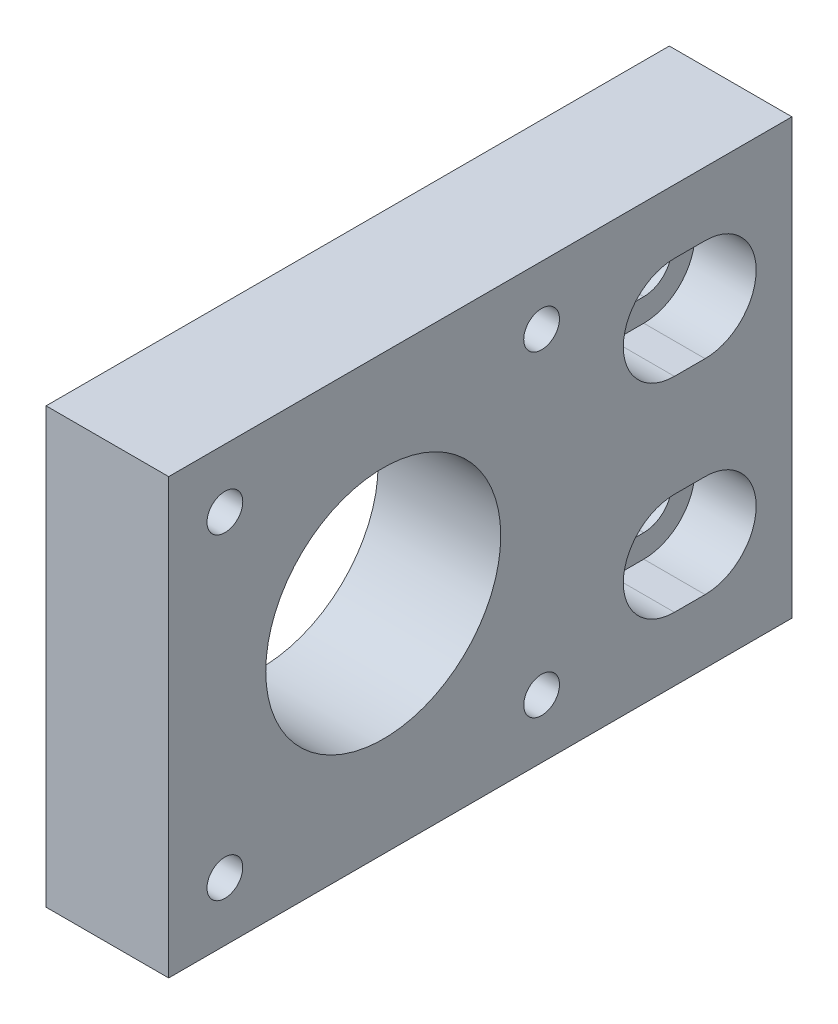
ISO-10303-21;
HEADER;
FILE_DESCRIPTION(('STEP AP214'),'2;1');
FILE_NAME('part.step','',(''),(''),'','','');
FILE_SCHEMA(('AUTOMOTIVE_DESIGN { 1 0 10303 214 1 1 1 1 }'));
ENDSEC;
DATA;
#1=APPLICATION_CONTEXT('core data for automotive mechanical design processes');
#2=APPLICATION_PROTOCOL_DEFINITION('international standard','automotive_design',2000,#1);
#3=PRODUCT_CONTEXT('',#1,'mechanical');
#4=PRODUCT('Part','Part','',(#3));
#5=PRODUCT_RELATED_PRODUCT_CATEGORY('part','',(#4));
#6=PRODUCT_DEFINITION_FORMATION('','',#4);
#7=PRODUCT_DEFINITION_CONTEXT('part definition',#1,'design');
#8=PRODUCT_DEFINITION('design','',#6,#7);
#9=PRODUCT_DEFINITION_SHAPE('','',#8);
#10=(LENGTH_UNIT() NAMED_UNIT(*) SI_UNIT(.MILLI.,.METRE.));
#11=(NAMED_UNIT(*) PLANE_ANGLE_UNIT() SI_UNIT($,.RADIAN.));
#12=(NAMED_UNIT(*) SI_UNIT($,.STERADIAN.) SOLID_ANGLE_UNIT());
#13=UNCERTAINTY_MEASURE_WITH_UNIT(LENGTH_MEASURE(1.E-05),#10,'distance_accuracy_value','');
#14=(GEOMETRIC_REPRESENTATION_CONTEXT(3) GLOBAL_UNCERTAINTY_ASSIGNED_CONTEXT((#13)) GLOBAL_UNIT_ASSIGNED_CONTEXT((#10,
#11,#12)) REPRESENTATION_CONTEXT('',''));
#15=CARTESIAN_POINT('',(0.,0.,0.));
#16=DIRECTION('',(0.,0.,1.));
#17=DIRECTION('',(1.,0.,0.));
#18=AXIS2_PLACEMENT_3D('',#15,#16,#17);
#19=CARTESIAN_POINT('',(12.,10.,-28.5));
#20=DIRECTION('',(-1.,0.,0.));
#21=DIRECTION('',(0.,0.,1.));
#22=AXIS2_PLACEMENT_3D('',#19,#20,#21);
#23=CYLINDRICAL_SURFACE('',#22,2.75);
#24=DIRECTION('',(-1.,0.,0.));
#25=VECTOR('',#24,1.);
#26=CARTESIAN_POINT('',(12.,12.75,-28.5));
#27=LINE('',#26,#25);
#28=CARTESIAN_POINT('',(6.,12.75,-28.5));
#29=VERTEX_POINT('',#28);
#30=CARTESIAN_POINT('',(0.,12.75,-28.5));
#31=VERTEX_POINT('',#30);
#32=EDGE_CURVE('E285',#29,#31,#27,.T.);
#33=ORIENTED_EDGE('',*,*,#32,.F.);
#34=CARTESIAN_POINT('',(6.,10.,-28.5));
#35=DIRECTION('',(1.,0.,0.));
#36=DIRECTION('',(0.,0.,-1.));
#37=AXIS2_PLACEMENT_3D('',#34,#35,#36);
#38=CIRCLE('',#37,2.75);
#39=CARTESIAN_POINT('',(6.,7.25,-28.5));
#40=VERTEX_POINT('',#39);
#41=EDGE_CURVE('E250',#29,#40,#38,.T.);
#42=ORIENTED_EDGE('',*,*,#41,.T.);
#43=DIRECTION('',(-1.,0.,0.));
#44=VECTOR('',#43,1.);
#45=CARTESIAN_POINT('',(12.,7.25,-28.5));
#46=LINE('',#45,#44);
#47=CARTESIAN_POINT('',(0.,7.25,-28.5));
#48=VERTEX_POINT('',#47);
#49=EDGE_CURVE('E291',#40,#48,#46,.T.);
#50=ORIENTED_EDGE('',*,*,#49,.T.);
#51=CARTESIAN_POINT('',(0.,10.,-28.5));
#52=DIRECTION('',(1.,0.,0.));
#53=DIRECTION('',(0.,0.,-1.));
#54=AXIS2_PLACEMENT_3D('',#51,#52,#53);
#55=CIRCLE('',#54,2.75);
#56=EDGE_CURVE('E273',#31,#48,#55,.T.);
#57=ORIENTED_EDGE('',*,*,#56,.F.);
#58=EDGE_LOOP('',(#33,#42,#50,#57));
#59=FACE_BOUND('',#58,.T.);
#60=ADVANCED_FACE('F33',(#59),#23,.F.);
#61=CARTESIAN_POINT('',(12.,7.25,-28.5));
#62=DIRECTION('',(0.,1.,0.));
#63=DIRECTION('',(0.,0.,1.));
#64=AXIS2_PLACEMENT_3D('',#61,#62,#63);
#65=PLANE('',#64);
#66=ORIENTED_EDGE('',*,*,#49,.F.);
#67=DIRECTION('',(0.,0.,-1.));
#68=VECTOR('',#67,1.);
#69=CARTESIAN_POINT('',(6.,7.25,-28.5));
#70=LINE('',#69,#68);
#71=CARTESIAN_POINT('',(6.,7.25,-31.5));
#72=VERTEX_POINT('',#71);
#73=EDGE_CURVE('E247',#40,#72,#70,.T.);
#74=ORIENTED_EDGE('',*,*,#73,.T.);
#75=DIRECTION('',(-1.,0.,0.));
#76=VECTOR('',#75,1.);
#77=CARTESIAN_POINT('',(12.,7.25,-31.5));
#78=LINE('',#77,#76);
#79=CARTESIAN_POINT('',(0.,7.25,-31.5));
#80=VERTEX_POINT('',#79);
#81=EDGE_CURVE('E289',#72,#80,#78,.T.);
#82=ORIENTED_EDGE('',*,*,#81,.T.);
#83=DIRECTION('',(0.,0.,-1.));
#84=VECTOR('',#83,1.);
#85=CARTESIAN_POINT('',(0.,7.25,-28.5));
#86=LINE('',#85,#84);
#87=EDGE_CURVE('E276',#48,#80,#86,.T.);
#88=ORIENTED_EDGE('',*,*,#87,.F.);
#89=EDGE_LOOP('',(#66,#74,#82,#88));
#90=FACE_BOUND('',#89,.T.);
#91=ADVANCED_FACE('F390',(#90),#65,.T.);
#92=CARTESIAN_POINT('',(12.,10.,-31.5));
#93=DIRECTION('',(-1.,0.,0.));
#94=DIRECTION('',(0.,0.,1.));
#95=AXIS2_PLACEMENT_3D('',#92,#93,#94);
#96=CYLINDRICAL_SURFACE('',#95,2.75);
#97=ORIENTED_EDGE('',*,*,#81,.F.);
#98=CARTESIAN_POINT('',(6.,10.,-31.5));
#99=DIRECTION('',(1.,0.,0.));
#100=DIRECTION('',(0.,0.,-1.));
#101=AXIS2_PLACEMENT_3D('',#98,#99,#100);
#102=CIRCLE('',#101,2.75);
#103=CARTESIAN_POINT('',(6.,12.75,-31.5));
#104=VERTEX_POINT('',#103);
#105=EDGE_CURVE('E244',#72,#104,#102,.T.);
#106=ORIENTED_EDGE('',*,*,#105,.T.);
#107=DIRECTION('',(-1.,0.,0.));
#108=VECTOR('',#107,1.);
#109=CARTESIAN_POINT('',(12.,12.75,-31.5));
#110=LINE('',#109,#108);
#111=CARTESIAN_POINT('',(0.,12.75,-31.5));
#112=VERTEX_POINT('',#111);
#113=EDGE_CURVE('E287',#104,#112,#110,.T.);
#114=ORIENTED_EDGE('',*,*,#113,.T.);
#115=CARTESIAN_POINT('',(0.,10.,-31.5));
#116=DIRECTION('',(1.,0.,0.));
#117=DIRECTION('',(0.,0.,-1.));
#118=AXIS2_PLACEMENT_3D('',#115,#116,#117);
#119=CIRCLE('',#118,2.75);
#120=EDGE_CURVE('E279',#80,#112,#119,.T.);
#121=ORIENTED_EDGE('',*,*,#120,.F.);
#122=EDGE_LOOP('',(#97,#106,#114,#121));
#123=FACE_BOUND('',#122,.T.);
#124=ADVANCED_FACE('F396',(#123),#96,.F.);
#125=CARTESIAN_POINT('',(12.,12.75,-28.5));
#126=DIRECTION('',(0.,-1.,0.));
#127=DIRECTION('',(0.,0.,-1.));
#128=AXIS2_PLACEMENT_3D('',#125,#126,#127);
#129=PLANE('',#128);
#130=ORIENTED_EDGE('',*,*,#113,.F.);
#131=DIRECTION('',(0.,0.,1.));
#132=VECTOR('',#131,1.);
#133=CARTESIAN_POINT('',(6.,12.75,-28.5));
#134=LINE('',#133,#132);
#135=EDGE_CURVE('E11',#104,#29,#134,.T.);
#136=ORIENTED_EDGE('',*,*,#135,.T.);
#137=ORIENTED_EDGE('',*,*,#32,.T.);
#138=DIRECTION('',(0.,0.,1.));
#139=VECTOR('',#138,1.);
#140=CARTESIAN_POINT('',(0.,12.75,-28.5));
#141=LINE('',#140,#139);
#142=EDGE_CURVE('E282',#112,#31,#141,.T.);
#143=ORIENTED_EDGE('',*,*,#142,.F.);
#144=EDGE_LOOP('',(#130,#136,#137,#143));
#145=FACE_BOUND('',#144,.T.);
#146=ADVANCED_FACE('F421',(#145),#129,.T.);
#147=CARTESIAN_POINT('',(12.,0.,0.));
#148=DIRECTION('',(-1.,0.,0.));
#149=DIRECTION('',(0.,0.,1.));
#150=AXIS2_PLACEMENT_3D('',#147,#148,#149);
#151=PLANE('',#150);
#152=DIRECTION('',(0.,0.,-1.));
#153=VECTOR('',#152,1.);
#154=CARTESIAN_POINT('',(12.,5.,-28.5));
#155=LINE('',#154,#153);
#156=CARTESIAN_POINT('',(12.,5.,-28.5));
#157=VERTEX_POINT('',#156);
#158=CARTESIAN_POINT('',(12.,5.,-31.5));
#159=VERTEX_POINT('',#158);
#160=EDGE_CURVE('E199',#157,#159,#155,.T.);
#161=ORIENTED_EDGE('',*,*,#160,.F.);
#162=CARTESIAN_POINT('',(12.,10.,-28.5));
#163=DIRECTION('',(1.,0.,0.));
#164=DIRECTION('',(0.,0.,-1.));
#165=AXIS2_PLACEMENT_3D('',#162,#163,#164);
#166=CIRCLE('',#165,5.);
#167=CARTESIAN_POINT('',(12.,15.,-28.5));
#168=VERTEX_POINT('',#167);
#169=EDGE_CURVE('E48',#168,#157,#166,.T.);
#170=ORIENTED_EDGE('',*,*,#169,.F.);
#171=DIRECTION('',(0.,0.,1.));
#172=VECTOR('',#171,1.);
#173=CARTESIAN_POINT('',(12.,15.,-28.5));
#174=LINE('',#173,#172);
#175=CARTESIAN_POINT('',(12.,15.,-31.5));
#176=VERTEX_POINT('',#175);
#177=EDGE_CURVE('E190',#176,#168,#174,.T.);
#178=ORIENTED_EDGE('',*,*,#177,.F.);
#179=CARTESIAN_POINT('',(12.,10.,-31.5));
#180=DIRECTION('',(1.,0.,0.));
#181=DIRECTION('',(0.,0.,-1.));
#182=AXIS2_PLACEMENT_3D('',#179,#180,#181);
#183=CIRCLE('',#182,5.);
#184=EDGE_CURVE('E193',#159,#176,#183,.T.);
#185=ORIENTED_EDGE('',*,*,#184,.F.);
#186=EDGE_LOOP('',(#161,#170,#178,#185));
#187=FACE_BOUND('',#186,.T.);
#188=DIRECTION('',(0.,0.,-1.));
#189=VECTOR('',#188,1.);
#190=CARTESIAN_POINT('',(12.,-15.,-28.5));
#191=LINE('',#190,#189);
#192=CARTESIAN_POINT('',(12.,-15.,-28.5));
#193=VERTEX_POINT('',#192);
#194=CARTESIAN_POINT('',(12.,-15.,-31.5));
#195=VERTEX_POINT('',#194);
#196=EDGE_CURVE('E225',#193,#195,#191,.T.);
#197=ORIENTED_EDGE('',*,*,#196,.F.);
#198=CARTESIAN_POINT('',(12.,-10.,-28.5));
#199=DIRECTION('',(1.,0.,0.));
#200=DIRECTION('',(0.,0.,1.));
#201=AXIS2_PLACEMENT_3D('',#198,#199,#200);
#202=CIRCLE('',#201,5.);
#203=CARTESIAN_POINT('',(12.,-5.00000000000001,-28.5));
#204=VERTEX_POINT('',#203);
#205=EDGE_CURVE('E56',#204,#193,#202,.T.);
#206=ORIENTED_EDGE('',*,*,#205,.F.);
#207=DIRECTION('',(0.,0.,1.));
#208=VECTOR('',#207,1.);
#209=CARTESIAN_POINT('',(12.,-5.00000000000001,-28.5));
#210=LINE('',#209,#208);
#211=CARTESIAN_POINT('',(12.,-5.00000000000001,-31.5));
#212=VERTEX_POINT('',#211);
#213=EDGE_CURVE('E214',#212,#204,#210,.T.);
#214=ORIENTED_EDGE('',*,*,#213,.F.);
#215=CARTESIAN_POINT('',(12.,-10.,-31.5));
#216=DIRECTION('',(1.,0.,0.));
#217=DIRECTION('',(0.,0.,1.));
#218=AXIS2_PLACEMENT_3D('',#215,#216,#217);
#219=CIRCLE('',#218,5.);
#220=EDGE_CURVE('E228',#195,#212,#219,.T.);
#221=ORIENTED_EDGE('',*,*,#220,.F.);
#222=EDGE_LOOP('',(#197,#206,#214,#221));
#223=FACE_BOUND('',#222,.T.);
#224=DIRECTION('',(0.,1.,0.));
#225=VECTOR('',#224,1.);
#226=CARTESIAN_POINT('',(12.,-21.25,-40.));
#227=LINE('',#226,#225);
#228=CARTESIAN_POINT('',(12.,-21.25,-40.));
#229=VERTEX_POINT('',#228);
#230=CARTESIAN_POINT('',(12.,21.25,-40.));
#231=VERTEX_POINT('',#230);
#232=EDGE_CURVE('E324',#229,#231,#227,.T.);
#233=ORIENTED_EDGE('',*,*,#232,.T.);
#234=DIRECTION('',(0.,0.,1.));
#235=VECTOR('',#234,1.);
#236=CARTESIAN_POINT('',(12.,21.25,21.));
#237=LINE('',#236,#235);
#238=CARTESIAN_POINT('',(12.,21.25,21.));
#239=VERTEX_POINT('',#238);
#240=EDGE_CURVE('E327',#231,#239,#237,.T.);
#241=ORIENTED_EDGE('',*,*,#240,.T.);
#242=DIRECTION('',(0.,-1.,0.));
#243=VECTOR('',#242,1.);
#244=CARTESIAN_POINT('',(12.,-21.25,21.));
#245=LINE('',#244,#243);
#246=CARTESIAN_POINT('',(12.,-21.25,21.));
#247=VERTEX_POINT('',#246);
#248=EDGE_CURVE('E330',#239,#247,#245,.T.);
#249=ORIENTED_EDGE('',*,*,#248,.T.);
#250=DIRECTION('',(0.,0.,-1.));
#251=VECTOR('',#250,1.);
#252=CARTESIAN_POINT('',(12.,-21.25,21.));
#253=LINE('',#252,#251);
#254=EDGE_CURVE('E332',#247,#229,#253,.T.);
#255=ORIENTED_EDGE('',*,*,#254,.T.);
#256=EDGE_LOOP('',(#233,#241,#249,#255));
#257=FACE_BOUND('',#256,.T.);
#258=CARTESIAN_POINT('',(12.,0.,0.));
#259=DIRECTION('',(1.,0.,0.));
#260=DIRECTION('',(0.,0.,-1.));
#261=AXIS2_PLACEMENT_3D('',#258,#259,#260);
#262=CIRCLE('',#261,11.5);
#263=CARTESIAN_POINT('',(12.,0.,-11.5));
#264=VERTEX_POINT('',#263);
#265=EDGE_CURVE('E318',#264,#264,#262,.T.);
#266=ORIENTED_EDGE('',*,*,#265,.F.);
#267=EDGE_LOOP('',(#266));
#268=FACE_BOUND('',#267,.T.);
#269=CARTESIAN_POINT('',(12.,15.5,15.5));
#270=DIRECTION('',(1.,0.,0.));
#271=DIRECTION('',(0.,0.,-1.));
#272=AXIS2_PLACEMENT_3D('',#269,#270,#271);
#273=CIRCLE('',#272,1.75);
#274=CARTESIAN_POINT('',(12.,15.5,13.75));
#275=VERTEX_POINT('',#274);
#276=EDGE_CURVE('E312',#275,#275,#273,.T.);
#277=ORIENTED_EDGE('',*,*,#276,.F.);
#278=EDGE_LOOP('',(#277));
#279=FACE_BOUND('',#278,.T.);
#280=CARTESIAN_POINT('',(12.,-15.5,-15.5));
#281=DIRECTION('',(1.,0.,0.));
#282=DIRECTION('',(0.,0.,-1.));
#283=AXIS2_PLACEMENT_3D('',#280,#281,#282);
#284=CIRCLE('',#283,1.75);
#285=CARTESIAN_POINT('',(12.,-15.5,-17.25));
#286=VERTEX_POINT('',#285);
#287=EDGE_CURVE('E306',#286,#286,#284,.T.);
#288=ORIENTED_EDGE('',*,*,#287,.F.);
#289=EDGE_LOOP('',(#288));
#290=FACE_BOUND('',#289,.T.);
#291=CARTESIAN_POINT('',(12.,15.5,-15.5));
#292=DIRECTION('',(1.,0.,0.));
#293=DIRECTION('',(0.,0.,1.));
#294=AXIS2_PLACEMENT_3D('',#291,#292,#293);
#295=CIRCLE('',#294,1.74999999999999);
#296=CARTESIAN_POINT('',(12.,15.5,-13.75));
#297=VERTEX_POINT('',#296);
#298=EDGE_CURVE('E300',#297,#297,#295,.T.);
#299=ORIENTED_EDGE('',*,*,#298,.F.);
#300=EDGE_LOOP('',(#299));
#301=FACE_BOUND('',#300,.T.);
#302=CARTESIAN_POINT('',(12.,-15.5,15.5));
#303=DIRECTION('',(1.,0.,0.));
#304=DIRECTION('',(0.,0.,1.));
#305=AXIS2_PLACEMENT_3D('',#302,#303,#304);
#306=CIRCLE('',#305,1.75);
#307=CARTESIAN_POINT('',(12.,-15.5,17.25));
#308=VERTEX_POINT('',#307);
#309=EDGE_CURVE('E294',#308,#308,#306,.T.);
#310=ORIENTED_EDGE('',*,*,#309,.F.);
#311=EDGE_LOOP('',(#310));
#312=FACE_BOUND('',#311,.T.);
#313=ADVANCED_FACE('F418',(#187,#223,#257,#268,#279,#290,#301,#312),#151,.F.);
#314=CARTESIAN_POINT('',(0.,0.,0.));
#315=DIRECTION('',(-1.,0.,0.));
#316=DIRECTION('',(0.,0.,1.));
#317=AXIS2_PLACEMENT_3D('',#314,#315,#316);
#318=PLANE('',#317);
#319=CARTESIAN_POINT('',(0.,15.5,-15.5));
#320=DIRECTION('',(1.,0.,0.));
#321=DIRECTION('',(0.,0.,1.));
#322=AXIS2_PLACEMENT_3D('',#319,#320,#321);
#323=CIRCLE('',#322,1.74999999999999);
#324=CARTESIAN_POINT('',(0.,15.5,-13.75));
#325=VERTEX_POINT('',#324);
#326=EDGE_CURVE('E297',#325,#325,#323,.T.);
#327=ORIENTED_EDGE('',*,*,#326,.T.);
#328=EDGE_LOOP('',(#327));
#329=FACE_BOUND('',#328,.T.);
#330=CARTESIAN_POINT('',(0.,15.5,15.5));
#331=DIRECTION('',(1.,0.,0.));
#332=DIRECTION('',(0.,0.,-1.));
#333=AXIS2_PLACEMENT_3D('',#330,#331,#332);
#334=CIRCLE('',#333,1.75);
#335=CARTESIAN_POINT('',(0.,15.5,13.75));
#336=VERTEX_POINT('',#335);
#337=EDGE_CURVE('E309',#336,#336,#334,.T.);
#338=ORIENTED_EDGE('',*,*,#337,.T.);
#339=EDGE_LOOP('',(#338));
#340=FACE_BOUND('',#339,.T.);
#341=DIRECTION('',(0.,1.,0.));
#342=VECTOR('',#341,1.);
#343=CARTESIAN_POINT('',(0.,-21.25,-40.));
#344=LINE('',#343,#342);
#345=CARTESIAN_POINT('',(0.,-21.25,-40.));
#346=VERTEX_POINT('',#345);
#347=CARTESIAN_POINT('',(0.,21.25,-40.));
#348=VERTEX_POINT('',#347);
#349=EDGE_CURVE('E321',#346,#348,#344,.T.);
#350=ORIENTED_EDGE('',*,*,#349,.F.);
#351=DIRECTION('',(0.,0.,-1.));
#352=VECTOR('',#351,1.);
#353=CARTESIAN_POINT('',(0.,-21.25,21.));
#354=LINE('',#353,#352);
#355=CARTESIAN_POINT('',(0.,-21.25,21.));
#356=VERTEX_POINT('',#355);
#357=EDGE_CURVE('E328',#356,#346,#354,.T.);
#358=ORIENTED_EDGE('',*,*,#357,.F.);
#359=DIRECTION('',(0.,-1.,0.));
#360=VECTOR('',#359,1.);
#361=CARTESIAN_POINT('',(0.,-21.25,21.));
#362=LINE('',#361,#360);
#363=CARTESIAN_POINT('',(0.,21.25,21.));
#364=VERTEX_POINT('',#363);
#365=EDGE_CURVE('E339',#364,#356,#362,.T.);
#366=ORIENTED_EDGE('',*,*,#365,.F.);
#367=DIRECTION('',(0.,0.,1.));
#368=VECTOR('',#367,1.);
#369=CARTESIAN_POINT('',(0.,21.25,21.));
#370=LINE('',#369,#368);
#371=EDGE_CURVE('E337',#348,#364,#370,.T.);
#372=ORIENTED_EDGE('',*,*,#371,.F.);
#373=EDGE_LOOP('',(#350,#358,#366,#372));
#374=FACE_BOUND('',#373,.T.);
#375=CARTESIAN_POINT('',(0.,0.,0.));
#376=DIRECTION('',(1.,0.,0.));
#377=DIRECTION('',(0.,0.,-1.));
#378=AXIS2_PLACEMENT_3D('',#375,#376,#377);
#379=CIRCLE('',#378,11.5);
#380=CARTESIAN_POINT('',(0.,0.,-11.5));
#381=VERTEX_POINT('',#380);
#382=EDGE_CURVE('E315',#381,#381,#379,.T.);
#383=ORIENTED_EDGE('',*,*,#382,.T.);
#384=EDGE_LOOP('',(#383));
#385=FACE_BOUND('',#384,.T.);
#386=CARTESIAN_POINT('',(0.,-15.5,-15.5));
#387=DIRECTION('',(1.,0.,0.));
#388=DIRECTION('',(0.,0.,-1.));
#389=AXIS2_PLACEMENT_3D('',#386,#387,#388);
#390=CIRCLE('',#389,1.75);
#391=CARTESIAN_POINT('',(0.,-15.5,-17.25));
#392=VERTEX_POINT('',#391);
#393=EDGE_CURVE('E303',#392,#392,#390,.T.);
#394=ORIENTED_EDGE('',*,*,#393,.T.);
#395=EDGE_LOOP('',(#394));
#396=FACE_BOUND('',#395,.T.);
#397=CARTESIAN_POINT('',(0.,-15.5,15.5));
#398=DIRECTION('',(1.,0.,0.));
#399=DIRECTION('',(0.,0.,1.));
#400=AXIS2_PLACEMENT_3D('',#397,#398,#399);
#401=CIRCLE('',#400,1.75);
#402=CARTESIAN_POINT('',(0.,-15.5,17.25));
#403=VERTEX_POINT('',#402);
#404=EDGE_CURVE('E293',#403,#403,#401,.T.);
#405=ORIENTED_EDGE('',*,*,#404,.T.);
#406=EDGE_LOOP('',(#405));
#407=FACE_BOUND('',#406,.T.);
#408=ORIENTED_EDGE('',*,*,#142,.T.);
#409=ORIENTED_EDGE('',*,*,#56,.T.);
#410=ORIENTED_EDGE('',*,*,#87,.T.);
#411=ORIENTED_EDGE('',*,*,#120,.T.);
#412=EDGE_LOOP('',(#408,#409,#410,#411));
#413=FACE_BOUND('',#412,.T.);
#414=DIRECTION('',(0.,0.,1.));
#415=VECTOR('',#414,1.);
#416=CARTESIAN_POINT('',(0.,-7.25,-28.5));
#417=LINE('',#416,#415);
#418=CARTESIAN_POINT('',(0.,-7.24999999999999,-31.5));
#419=VERTEX_POINT('',#418);
#420=CARTESIAN_POINT('',(0.,-7.25,-28.5));
#421=VERTEX_POINT('',#420);
#422=EDGE_CURVE('E262',#419,#421,#417,.T.);
#423=ORIENTED_EDGE('',*,*,#422,.T.);
#424=CARTESIAN_POINT('',(0.,-9.99999999999999,-28.5));
#425=DIRECTION('',(1.,0.,0.));
#426=DIRECTION('',(0.,0.,1.));
#427=AXIS2_PLACEMENT_3D('',#424,#425,#426);
#428=CIRCLE('',#427,2.75);
#429=CARTESIAN_POINT('',(0.,-12.75,-28.5));
#430=VERTEX_POINT('',#429);
#431=EDGE_CURVE('E253',#421,#430,#428,.T.);
#432=ORIENTED_EDGE('',*,*,#431,.T.);
#433=DIRECTION('',(0.,0.,-1.));
#434=VECTOR('',#433,1.);
#435=CARTESIAN_POINT('',(0.,-12.75,-28.5));
#436=LINE('',#435,#434);
#437=CARTESIAN_POINT('',(0.,-12.75,-31.5));
#438=VERTEX_POINT('',#437);
#439=EDGE_CURVE('E256',#430,#438,#436,.T.);
#440=ORIENTED_EDGE('',*,*,#439,.T.);
#441=CARTESIAN_POINT('',(0.,-9.99999999999999,-31.5));
#442=DIRECTION('',(1.,0.,0.));
#443=DIRECTION('',(0.,0.,1.));
#444=AXIS2_PLACEMENT_3D('',#441,#442,#443);
#445=CIRCLE('',#444,2.75);
#446=EDGE_CURVE('E259',#438,#419,#445,.T.);
#447=ORIENTED_EDGE('',*,*,#446,.T.);
#448=EDGE_LOOP('',(#423,#432,#440,#447));
#449=FACE_BOUND('',#448,.T.);
#450=ADVANCED_FACE('F370',(#329,#340,#374,#385,#396,#407,#413,#449),#318,.T.);
#451=CARTESIAN_POINT('',(12.,-21.25,-40.));
#452=DIRECTION('',(0.,0.,1.));
#453=DIRECTION('',(1.,0.,0.));
#454=AXIS2_PLACEMENT_3D('',#451,#452,#453);
#455=PLANE('',#454);
#456=ORIENTED_EDGE('',*,*,#349,.T.);
#457=DIRECTION('',(-1.,0.,0.));
#458=VECTOR('',#457,1.);
#459=CARTESIAN_POINT('',(12.,21.25,-40.));
#460=LINE('',#459,#458);
#461=EDGE_CURVE('E350',#231,#348,#460,.T.);
#462=ORIENTED_EDGE('',*,*,#461,.F.);
#463=ORIENTED_EDGE('',*,*,#232,.F.);
#464=DIRECTION('',(-1.,0.,0.));
#465=VECTOR('',#464,1.);
#466=CARTESIAN_POINT('',(12.,-21.25,-40.));
#467=LINE('',#466,#465);
#468=EDGE_CURVE('E334',#229,#346,#467,.T.);
#469=ORIENTED_EDGE('',*,*,#468,.T.);
#470=EDGE_LOOP('',(#456,#462,#463,#469));
#471=FACE_BOUND('',#470,.T.);
#472=ADVANCED_FACE('F35',(#471),#455,.F.);
#473=CARTESIAN_POINT('',(12.,21.25,21.));
#474=DIRECTION('',(0.,-1.,0.));
#475=DIRECTION('',(0.,0.,-1.));
#476=AXIS2_PLACEMENT_3D('',#473,#474,#475);
#477=PLANE('',#476);
#478=ORIENTED_EDGE('',*,*,#371,.T.);
#479=DIRECTION('',(-1.,0.,0.));
#480=VECTOR('',#479,1.);
#481=CARTESIAN_POINT('',(12.,21.25,21.));
#482=LINE('',#481,#480);
#483=EDGE_CURVE('E347',#239,#364,#482,.T.);
#484=ORIENTED_EDGE('',*,*,#483,.F.);
#485=ORIENTED_EDGE('',*,*,#240,.F.);
#486=ORIENTED_EDGE('',*,*,#461,.T.);
#487=EDGE_LOOP('',(#478,#484,#485,#486));
#488=FACE_BOUND('',#487,.T.);
#489=ADVANCED_FACE('F431',(#488),#477,.F.);
#490=CARTESIAN_POINT('',(12.,-21.25,21.));
#491=DIRECTION('',(0.,0.,-1.));
#492=DIRECTION('',(-1.,0.,0.));
#493=AXIS2_PLACEMENT_3D('',#490,#491,#492);
#494=PLANE('',#493);
#495=ORIENTED_EDGE('',*,*,#365,.T.);
#496=DIRECTION('',(-1.,0.,0.));
#497=VECTOR('',#496,1.);
#498=CARTESIAN_POINT('',(12.,-21.25,21.));
#499=LINE('',#498,#497);
#500=EDGE_CURVE('E344',#247,#356,#499,.T.);
#501=ORIENTED_EDGE('',*,*,#500,.F.);
#502=ORIENTED_EDGE('',*,*,#248,.F.);
#503=ORIENTED_EDGE('',*,*,#483,.T.);
#504=EDGE_LOOP('',(#495,#501,#502,#503));
#505=FACE_BOUND('',#504,.T.);
#506=ADVANCED_FACE('F428',(#505),#494,.F.);
#507=CARTESIAN_POINT('',(12.,-21.25,21.));
#508=DIRECTION('',(0.,1.,0.));
#509=DIRECTION('',(0.,0.,1.));
#510=AXIS2_PLACEMENT_3D('',#507,#508,#509);
#511=PLANE('',#510);
#512=ORIENTED_EDGE('',*,*,#357,.T.);
#513=ORIENTED_EDGE('',*,*,#468,.F.);
#514=ORIENTED_EDGE('',*,*,#254,.F.);
#515=ORIENTED_EDGE('',*,*,#500,.T.);
#516=EDGE_LOOP('',(#512,#513,#514,#515));
#517=FACE_BOUND('',#516,.T.);
#518=ADVANCED_FACE('F416',(#517),#511,.F.);
#519=CARTESIAN_POINT('',(12.,0.,0.));
#520=DIRECTION('',(-1.,0.,0.));
#521=DIRECTION('',(0.,0.,1.));
#522=AXIS2_PLACEMENT_3D('',#519,#520,#521);
#523=CYLINDRICAL_SURFACE('',#522,11.5);
#524=ORIENTED_EDGE('',*,*,#265,.T.);
#525=EDGE_LOOP('',(#524));
#526=FACE_BOUND('',#525,.T.);
#527=ORIENTED_EDGE('',*,*,#382,.F.);
#528=EDGE_LOOP('',(#527));
#529=FACE_BOUND('',#528,.T.);
#530=ADVANCED_FACE('F412',(#526,#529),#523,.F.);
#531=CARTESIAN_POINT('',(12.,15.5,15.5));
#532=DIRECTION('',(-1.,0.,0.));
#533=DIRECTION('',(0.,0.,1.));
#534=AXIS2_PLACEMENT_3D('',#531,#532,#533);
#535=CYLINDRICAL_SURFACE('',#534,1.75);
#536=ORIENTED_EDGE('',*,*,#276,.T.);
#537=EDGE_LOOP('',(#536));
#538=FACE_BOUND('',#537,.T.);
#539=ORIENTED_EDGE('',*,*,#337,.F.);
#540=EDGE_LOOP('',(#539));
#541=FACE_BOUND('',#540,.T.);
#542=ADVANCED_FACE('F408',(#538,#541),#535,.F.);
#543=CARTESIAN_POINT('',(12.,-15.5,-15.5));
#544=DIRECTION('',(-1.,0.,0.));
#545=DIRECTION('',(0.,0.,1.));
#546=AXIS2_PLACEMENT_3D('',#543,#544,#545);
#547=CYLINDRICAL_SURFACE('',#546,1.75);
#548=ORIENTED_EDGE('',*,*,#287,.T.);
#549=EDGE_LOOP('',(#548));
#550=FACE_BOUND('',#549,.T.);
#551=ORIENTED_EDGE('',*,*,#393,.F.);
#552=EDGE_LOOP('',(#551));
#553=FACE_BOUND('',#552,.T.);
#554=ADVANCED_FACE('F404',(#550,#553),#547,.F.);
#555=CARTESIAN_POINT('',(12.,15.5,-15.5));
#556=DIRECTION('',(-1.,0.,0.));
#557=DIRECTION('',(0.,0.,1.));
#558=AXIS2_PLACEMENT_3D('',#555,#556,#557);
#559=CYLINDRICAL_SURFACE('',#558,1.74999999999999);
#560=ORIENTED_EDGE('',*,*,#298,.T.);
#561=EDGE_LOOP('',(#560));
#562=FACE_BOUND('',#561,.T.);
#563=ORIENTED_EDGE('',*,*,#326,.F.);
#564=EDGE_LOOP('',(#563));
#565=FACE_BOUND('',#564,.T.);
#566=ADVANCED_FACE('F385',(#562,#565),#559,.F.);
#567=CARTESIAN_POINT('',(12.,-15.5,15.5));
#568=DIRECTION('',(-1.,0.,0.));
#569=DIRECTION('',(0.,0.,1.));
#570=AXIS2_PLACEMENT_3D('',#567,#568,#569);
#571=CYLINDRICAL_SURFACE('',#570,1.75);
#572=ORIENTED_EDGE('',*,*,#309,.T.);
#573=EDGE_LOOP('',(#572));
#574=FACE_BOUND('',#573,.T.);
#575=ORIENTED_EDGE('',*,*,#404,.F.);
#576=EDGE_LOOP('',(#575));
#577=FACE_BOUND('',#576,.T.);
#578=ADVANCED_FACE('F378',(#574,#577),#571,.F.);
#579=CARTESIAN_POINT('',(12.,-9.99999999999999,-28.5));
#580=DIRECTION('',(-1.,0.,0.));
#581=DIRECTION('',(0.,0.,1.));
#582=AXIS2_PLACEMENT_3D('',#579,#580,#581);
#583=CYLINDRICAL_SURFACE('',#582,2.75);
#584=CARTESIAN_POINT('',(6.,-9.99999999999999,-28.5));
#585=DIRECTION('',(-1.,0.,0.));
#586=DIRECTION('',(0.,0.,1.));
#587=AXIS2_PLACEMENT_3D('',#584,#585,#586);
#588=CIRCLE('',#587,2.75);
#589=CARTESIAN_POINT('',(6.,-12.75,-28.5));
#590=VERTEX_POINT('',#589);
#591=CARTESIAN_POINT('',(6.,-7.25,-28.5));
#592=VERTEX_POINT('',#591);
#593=EDGE_CURVE('E242',#590,#592,#588,.T.);
#594=ORIENTED_EDGE('',*,*,#593,.F.);
#595=DIRECTION('',(-1.,0.,0.));
#596=VECTOR('',#595,1.);
#597=CARTESIAN_POINT('',(12.,-12.75,-28.5));
#598=LINE('',#597,#596);
#599=EDGE_CURVE('E271',#590,#430,#598,.T.);
#600=ORIENTED_EDGE('',*,*,#599,.T.);
#601=ORIENTED_EDGE('',*,*,#431,.F.);
#602=DIRECTION('',(-1.,0.,0.));
#603=VECTOR('',#602,1.);
#604=CARTESIAN_POINT('',(12.,-7.25,-28.5));
#605=LINE('',#604,#603);
#606=EDGE_CURVE('E265',#592,#421,#605,.T.);
#607=ORIENTED_EDGE('',*,*,#606,.F.);
#608=EDGE_LOOP('',(#594,#600,#601,#607));
#609=FACE_BOUND('',#608,.T.);
#610=ADVANCED_FACE('F376',(#609),#583,.F.);
#611=CARTESIAN_POINT('',(12.,-12.75,-28.5));
#612=DIRECTION('',(0.,1.,0.));
#613=DIRECTION('',(0.,0.,1.));
#614=AXIS2_PLACEMENT_3D('',#611,#612,#613);
#615=PLANE('',#614);
#616=DIRECTION('',(0.,0.,1.));
#617=VECTOR('',#616,1.);
#618=CARTESIAN_POINT('',(6.,-12.75,-28.5));
#619=LINE('',#618,#617);
#620=CARTESIAN_POINT('',(6.,-12.75,-31.5));
#621=VERTEX_POINT('',#620);
#622=EDGE_CURVE('E240',#621,#590,#619,.T.);
#623=ORIENTED_EDGE('',*,*,#622,.F.);
#624=DIRECTION('',(-1.,0.,0.));
#625=VECTOR('',#624,1.);
#626=CARTESIAN_POINT('',(12.,-12.75,-31.5));
#627=LINE('',#626,#625);
#628=EDGE_CURVE('E269',#621,#438,#627,.T.);
#629=ORIENTED_EDGE('',*,*,#628,.T.);
#630=ORIENTED_EDGE('',*,*,#439,.F.);
#631=ORIENTED_EDGE('',*,*,#599,.F.);
#632=EDGE_LOOP('',(#623,#629,#630,#631));
#633=FACE_BOUND('',#632,.T.);
#634=ADVANCED_FACE('F374',(#633),#615,.T.);
#635=CARTESIAN_POINT('',(12.,-9.99999999999999,-31.5));
#636=DIRECTION('',(-1.,0.,0.));
#637=DIRECTION('',(0.,0.,1.));
#638=AXIS2_PLACEMENT_3D('',#635,#636,#637);
#639=CYLINDRICAL_SURFACE('',#638,2.75);
#640=CARTESIAN_POINT('',(6.,-9.99999999999999,-31.5));
#641=DIRECTION('',(-1.,0.,0.));
#642=DIRECTION('',(0.,0.,1.));
#643=AXIS2_PLACEMENT_3D('',#640,#641,#642);
#644=CIRCLE('',#643,2.75);
#645=CARTESIAN_POINT('',(6.,-7.25,-31.5));
#646=VERTEX_POINT('',#645);
#647=EDGE_CURVE('E206',#646,#621,#644,.T.);
#648=ORIENTED_EDGE('',*,*,#647,.F.);
#649=DIRECTION('',(-1.,0.,0.));
#650=VECTOR('',#649,1.);
#651=CARTESIAN_POINT('',(12.,-7.24999999999999,-31.5));
#652=LINE('',#651,#650);
#653=EDGE_CURVE('E267',#646,#419,#652,.T.);
#654=ORIENTED_EDGE('',*,*,#653,.T.);
#655=ORIENTED_EDGE('',*,*,#446,.F.);
#656=ORIENTED_EDGE('',*,*,#628,.F.);
#657=EDGE_LOOP('',(#648,#654,#655,#656));
#658=FACE_BOUND('',#657,.T.);
#659=ADVANCED_FACE('F364',(#658),#639,.F.);
#660=CARTESIAN_POINT('',(12.,-7.25,-28.5));
#661=DIRECTION('',(0.,-1.,0.));
#662=DIRECTION('',(0.,0.,-1.));
#663=AXIS2_PLACEMENT_3D('',#660,#661,#662);
#664=PLANE('',#663);
#665=DIRECTION('',(0.,0.,-1.));
#666=VECTOR('',#665,1.);
#667=CARTESIAN_POINT('',(6.,-7.25,-28.5));
#668=LINE('',#667,#666);
#669=EDGE_CURVE('E41',#592,#646,#668,.T.);
#670=ORIENTED_EDGE('',*,*,#669,.F.);
#671=ORIENTED_EDGE('',*,*,#606,.T.);
#672=ORIENTED_EDGE('',*,*,#422,.F.);
#673=ORIENTED_EDGE('',*,*,#653,.F.);
#674=EDGE_LOOP('',(#670,#671,#672,#673));
#675=FACE_BOUND('',#674,.T.);
#676=ADVANCED_FACE('F367',(#675),#664,.T.);
#677=CARTESIAN_POINT('',(6.,-10.,-28.5));
#678=DIRECTION('',(1.,0.,0.));
#679=DIRECTION('',(0.,0.,-1.));
#680=AXIS2_PLACEMENT_3D('',#677,#678,#679);
#681=CYLINDRICAL_SURFACE('',#680,5.);
#682=ORIENTED_EDGE('',*,*,#205,.T.);
#683=DIRECTION('',(1.,0.,0.));
#684=VECTOR('',#683,1.);
#685=CARTESIAN_POINT('',(6.,-15.,-28.5));
#686=LINE('',#685,#684);
#687=CARTESIAN_POINT('',(6.,-15.,-28.5));
#688=VERTEX_POINT('',#687);
#689=EDGE_CURVE('E223',#688,#193,#686,.T.);
#690=ORIENTED_EDGE('',*,*,#689,.F.);
#691=CARTESIAN_POINT('',(6.,-10.,-28.5));
#692=DIRECTION('',(1.,0.,0.));
#693=DIRECTION('',(0.,0.,1.));
#694=AXIS2_PLACEMENT_3D('',#691,#692,#693);
#695=CIRCLE('',#694,5.);
#696=CARTESIAN_POINT('',(6.,-5.00000000000001,-28.5));
#697=VERTEX_POINT('',#696);
#698=EDGE_CURVE('E210',#697,#688,#695,.T.);
#699=ORIENTED_EDGE('',*,*,#698,.F.);
#700=DIRECTION('',(1.,0.,0.));
#701=VECTOR('',#700,1.);
#702=CARTESIAN_POINT('',(6.,-5.00000000000001,-28.5));
#703=LINE('',#702,#701);
#704=EDGE_CURVE('E200',#697,#204,#703,.T.);
#705=ORIENTED_EDGE('',*,*,#704,.T.);
#706=EDGE_LOOP('',(#682,#690,#699,#705));
#707=FACE_BOUND('',#706,.T.);
#708=ADVANCED_FACE('F500',(#707),#681,.F.);
#709=CARTESIAN_POINT('',(6.,-5.00000000000001,-28.5));
#710=DIRECTION('',(0.,1.,0.));
#711=DIRECTION('',(0.,0.,1.));
#712=AXIS2_PLACEMENT_3D('',#709,#710,#711);
#713=PLANE('',#712);
#714=ORIENTED_EDGE('',*,*,#213,.T.);
#715=ORIENTED_EDGE('',*,*,#704,.F.);
#716=DIRECTION('',(0.,0.,1.));
#717=VECTOR('',#716,1.);
#718=CARTESIAN_POINT('',(6.,-5.00000000000001,-28.5));
#719=LINE('',#718,#717);
#720=CARTESIAN_POINT('',(6.,-5.00000000000001,-31.5));
#721=VERTEX_POINT('',#720);
#722=EDGE_CURVE('E220',#721,#697,#719,.T.);
#723=ORIENTED_EDGE('',*,*,#722,.F.);
#724=DIRECTION('',(1.,0.,0.));
#725=VECTOR('',#724,1.);
#726=CARTESIAN_POINT('',(6.,-5.00000000000001,-31.5));
#727=LINE('',#726,#725);
#728=EDGE_CURVE('E234',#721,#212,#727,.T.);
#729=ORIENTED_EDGE('',*,*,#728,.T.);
#730=EDGE_LOOP('',(#714,#715,#723,#729));
#731=FACE_BOUND('',#730,.T.);
#732=ADVANCED_FACE('F496',(#731),#713,.F.);
#733=CARTESIAN_POINT('',(6.,-10.,-31.5));
#734=DIRECTION('',(1.,0.,0.));
#735=DIRECTION('',(0.,0.,-1.));
#736=AXIS2_PLACEMENT_3D('',#733,#734,#735);
#737=CYLINDRICAL_SURFACE('',#736,5.);
#738=ORIENTED_EDGE('',*,*,#220,.T.);
#739=ORIENTED_EDGE('',*,*,#728,.F.);
#740=CARTESIAN_POINT('',(6.,-10.,-31.5));
#741=DIRECTION('',(1.,0.,0.));
#742=DIRECTION('',(0.,0.,1.));
#743=AXIS2_PLACEMENT_3D('',#740,#741,#742);
#744=CIRCLE('',#743,5.);
#745=CARTESIAN_POINT('',(6.,-15.,-31.5));
#746=VERTEX_POINT('',#745);
#747=EDGE_CURVE('E217',#746,#721,#744,.T.);
#748=ORIENTED_EDGE('',*,*,#747,.F.);
#749=DIRECTION('',(1.,0.,0.));
#750=VECTOR('',#749,1.);
#751=CARTESIAN_POINT('',(6.,-15.,-31.5));
#752=LINE('',#751,#750);
#753=EDGE_CURVE('E236',#746,#195,#752,.T.);
#754=ORIENTED_EDGE('',*,*,#753,.T.);
#755=EDGE_LOOP('',(#738,#739,#748,#754));
#756=FACE_BOUND('',#755,.T.);
#757=ADVANCED_FACE('F499',(#756),#737,.F.);
#758=CARTESIAN_POINT('',(6.,-15.,-28.5));
#759=DIRECTION('',(0.,-1.,0.));
#760=DIRECTION('',(0.,0.,-1.));
#761=AXIS2_PLACEMENT_3D('',#758,#759,#760);
#762=PLANE('',#761);
#763=ORIENTED_EDGE('',*,*,#196,.T.);
#764=ORIENTED_EDGE('',*,*,#753,.F.);
#765=DIRECTION('',(0.,0.,-1.));
#766=VECTOR('',#765,1.);
#767=CARTESIAN_POINT('',(6.,-15.,-28.5));
#768=LINE('',#767,#766);
#769=EDGE_CURVE('E213',#688,#746,#768,.T.);
#770=ORIENTED_EDGE('',*,*,#769,.F.);
#771=ORIENTED_EDGE('',*,*,#689,.T.);
#772=EDGE_LOOP('',(#763,#764,#770,#771));
#773=FACE_BOUND('',#772,.T.);
#774=ADVANCED_FACE('F495',(#773),#762,.F.);
#775=CARTESIAN_POINT('',(6.,-10.,-28.5));
#776=DIRECTION('',(-1.,0.,0.));
#777=DIRECTION('',(0.,0.,1.));
#778=AXIS2_PLACEMENT_3D('',#775,#776,#777);
#779=PLANE('',#778);
#780=ORIENTED_EDGE('',*,*,#593,.T.);
#781=ORIENTED_EDGE('',*,*,#669,.T.);
#782=ORIENTED_EDGE('',*,*,#647,.T.);
#783=ORIENTED_EDGE('',*,*,#622,.T.);
#784=EDGE_LOOP('',(#780,#781,#782,#783));
#785=FACE_BOUND('',#784,.T.);
#786=ORIENTED_EDGE('',*,*,#698,.T.);
#787=ORIENTED_EDGE('',*,*,#769,.T.);
#788=ORIENTED_EDGE('',*,*,#747,.T.);
#789=ORIENTED_EDGE('',*,*,#722,.T.);
#790=EDGE_LOOP('',(#786,#787,#788,#789));
#791=FACE_BOUND('',#790,.T.);
#792=ADVANCED_FACE('F355',(#785,#791),#779,.F.);
#793=CARTESIAN_POINT('',(6.,10.,-28.5));
#794=DIRECTION('',(1.,0.,0.));
#795=DIRECTION('',(0.,0.,-1.));
#796=AXIS2_PLACEMENT_3D('',#793,#794,#795);
#797=CYLINDRICAL_SURFACE('',#796,5.);
#798=ORIENTED_EDGE('',*,*,#169,.T.);
#799=DIRECTION('',(1.,0.,0.));
#800=VECTOR('',#799,1.);
#801=CARTESIAN_POINT('',(6.,5.,-28.5));
#802=LINE('',#801,#800);
#803=CARTESIAN_POINT('',(6.,5.,-28.5));
#804=VERTEX_POINT('',#803);
#805=EDGE_CURVE('E168',#804,#157,#802,.T.);
#806=ORIENTED_EDGE('',*,*,#805,.F.);
#807=CARTESIAN_POINT('',(6.,10.,-28.5));
#808=DIRECTION('',(1.,0.,0.));
#809=DIRECTION('',(0.,0.,-1.));
#810=AXIS2_PLACEMENT_3D('',#807,#808,#809);
#811=CIRCLE('',#810,5.);
#812=CARTESIAN_POINT('',(6.,15.,-28.5));
#813=VERTEX_POINT('',#812);
#814=EDGE_CURVE('E172',#813,#804,#811,.T.);
#815=ORIENTED_EDGE('',*,*,#814,.F.);
#816=DIRECTION('',(1.,0.,0.));
#817=VECTOR('',#816,1.);
#818=CARTESIAN_POINT('',(6.,15.,-28.5));
#819=LINE('',#818,#817);
#820=EDGE_CURVE('E204',#813,#168,#819,.T.);
#821=ORIENTED_EDGE('',*,*,#820,.T.);
#822=EDGE_LOOP('',(#798,#806,#815,#821));
#823=FACE_BOUND('',#822,.T.);
#824=ADVANCED_FACE('F170',(#823),#797,.F.);
#825=CARTESIAN_POINT('',(6.,15.,-28.5));
#826=DIRECTION('',(0.,1.,0.));
#827=DIRECTION('',(0.,0.,1.));
#828=AXIS2_PLACEMENT_3D('',#825,#826,#827);
#829=PLANE('',#828);
#830=ORIENTED_EDGE('',*,*,#177,.T.);
#831=ORIENTED_EDGE('',*,*,#820,.F.);
#832=DIRECTION('',(0.,0.,1.));
#833=VECTOR('',#832,1.);
#834=CARTESIAN_POINT('',(6.,15.,-28.5));
#835=LINE('',#834,#833);
#836=CARTESIAN_POINT('',(6.,15.,-31.5));
#837=VERTEX_POINT('',#836);
#838=EDGE_CURVE('E178',#837,#813,#835,.T.);
#839=ORIENTED_EDGE('',*,*,#838,.F.);
#840=DIRECTION('',(1.,0.,0.));
#841=VECTOR('',#840,1.);
#842=CARTESIAN_POINT('',(6.,15.,-31.5));
#843=LINE('',#842,#841);
#844=EDGE_CURVE('E207',#837,#176,#843,.T.);
#845=ORIENTED_EDGE('',*,*,#844,.T.);
#846=EDGE_LOOP('',(#830,#831,#839,#845));
#847=FACE_BOUND('',#846,.T.);
#848=ADVANCED_FACE('F484',(#847),#829,.F.);
#849=CARTESIAN_POINT('',(6.,10.,-31.5));
#850=DIRECTION('',(1.,0.,0.));
#851=DIRECTION('',(0.,0.,-1.));
#852=AXIS2_PLACEMENT_3D('',#849,#850,#851);
#853=CYLINDRICAL_SURFACE('',#852,5.);
#854=ORIENTED_EDGE('',*,*,#184,.T.);
#855=ORIENTED_EDGE('',*,*,#844,.F.);
#856=CARTESIAN_POINT('',(6.,10.,-31.5));
#857=DIRECTION('',(1.,0.,0.));
#858=DIRECTION('',(0.,0.,-1.));
#859=AXIS2_PLACEMENT_3D('',#856,#857,#858);
#860=CIRCLE('',#859,5.);
#861=CARTESIAN_POINT('',(6.,5.,-31.5));
#862=VERTEX_POINT('',#861);
#863=EDGE_CURVE('E186',#862,#837,#860,.T.);
#864=ORIENTED_EDGE('',*,*,#863,.F.);
#865=DIRECTION('',(1.,0.,0.));
#866=VECTOR('',#865,1.);
#867=CARTESIAN_POINT('',(6.,5.,-31.5));
#868=LINE('',#867,#866);
#869=EDGE_CURVE('E177',#862,#159,#868,.T.);
#870=ORIENTED_EDGE('',*,*,#869,.T.);
#871=EDGE_LOOP('',(#854,#855,#864,#870));
#872=FACE_BOUND('',#871,.T.);
#873=ADVANCED_FACE('F481',(#872),#853,.F.);
#874=CARTESIAN_POINT('',(6.,5.,-28.5));
#875=DIRECTION('',(0.,-1.,0.));
#876=DIRECTION('',(0.,0.,-1.));
#877=AXIS2_PLACEMENT_3D('',#874,#875,#876);
#878=PLANE('',#877);
#879=ORIENTED_EDGE('',*,*,#160,.T.);
#880=ORIENTED_EDGE('',*,*,#869,.F.);
#881=DIRECTION('',(0.,0.,-1.));
#882=VECTOR('',#881,1.);
#883=CARTESIAN_POINT('',(6.,5.,-28.5));
#884=LINE('',#883,#882);
#885=EDGE_CURVE('E181',#804,#862,#884,.T.);
#886=ORIENTED_EDGE('',*,*,#885,.F.);
#887=ORIENTED_EDGE('',*,*,#805,.T.);
#888=EDGE_LOOP('',(#879,#880,#886,#887));
#889=FACE_BOUND('',#888,.T.);
#890=ADVANCED_FACE('F182',(#889),#878,.F.);
#891=CARTESIAN_POINT('',(6.,10.,-28.5));
#892=DIRECTION('',(1.,0.,0.));
#893=DIRECTION('',(0.,0.,-1.));
#894=AXIS2_PLACEMENT_3D('',#891,#892,#893);
#895=PLANE('',#894);
#896=ORIENTED_EDGE('',*,*,#135,.F.);
#897=ORIENTED_EDGE('',*,*,#105,.F.);
#898=ORIENTED_EDGE('',*,*,#73,.F.);
#899=ORIENTED_EDGE('',*,*,#41,.F.);
#900=EDGE_LOOP('',(#896,#897,#898,#899));
#901=FACE_BOUND('',#900,.T.);
#902=ORIENTED_EDGE('',*,*,#814,.T.);
#903=ORIENTED_EDGE('',*,*,#885,.T.);
#904=ORIENTED_EDGE('',*,*,#863,.T.);
#905=ORIENTED_EDGE('',*,*,#838,.T.);
#906=EDGE_LOOP('',(#902,#903,#904,#905));
#907=FACE_BOUND('',#906,.T.);
#908=ADVANCED_FACE('F188',(#901,#907),#895,.T.);
#909=CLOSED_SHELL('',(#60,#91,#124,#146,#313,#450,#472,#489,#506,#518,#530,#542,#554,#566,#578,
#610,#634,#659,#676,#708,#732,#757,#774,#792,#824,#848,#873,#890,#908));
#910=MANIFOLD_SOLID_BREP('B2',#909);
#911=ADVANCED_BREP_SHAPE_REPRESENTATION('',(#18,#910),#14);
#912=SHAPE_DEFINITION_REPRESENTATION(#9,#911);
ENDSEC;
END-ISO-10303-21;
